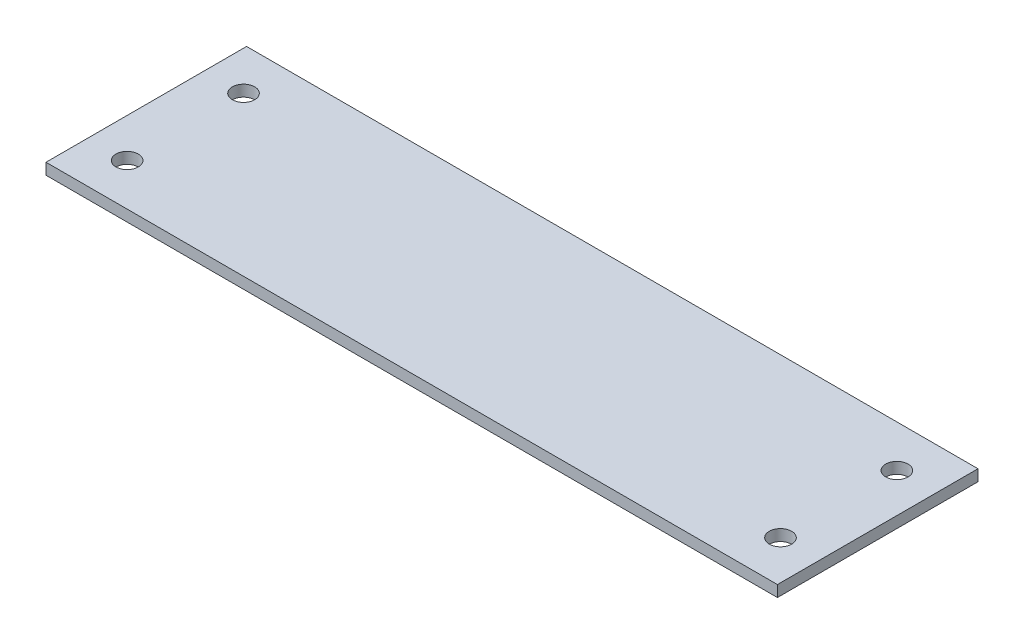
ISO-10303-21;
HEADER;
FILE_DESCRIPTION(('STEP AP214'),'2;1');
FILE_NAME('part.step','',(''),(''),'','','');
FILE_SCHEMA(('AUTOMOTIVE_DESIGN { 1 0 10303 214 1 1 1 1 }'));
ENDSEC;
DATA;
#1=APPLICATION_CONTEXT('core data for automotive mechanical design processes');
#2=APPLICATION_PROTOCOL_DEFINITION('international standard','automotive_design',2000,#1);
#3=PRODUCT_CONTEXT('',#1,'mechanical');
#4=PRODUCT('Part','Part','',(#3));
#5=PRODUCT_RELATED_PRODUCT_CATEGORY('part','',(#4));
#6=PRODUCT_DEFINITION_FORMATION('','',#4);
#7=PRODUCT_DEFINITION_CONTEXT('part definition',#1,'design');
#8=PRODUCT_DEFINITION('design','',#6,#7);
#9=PRODUCT_DEFINITION_SHAPE('','',#8);
#10=(LENGTH_UNIT() NAMED_UNIT(*) SI_UNIT(.MILLI.,.METRE.));
#11=(NAMED_UNIT(*) PLANE_ANGLE_UNIT() SI_UNIT($,.RADIAN.));
#12=(NAMED_UNIT(*) SI_UNIT($,.STERADIAN.) SOLID_ANGLE_UNIT());
#13=UNCERTAINTY_MEASURE_WITH_UNIT(LENGTH_MEASURE(1.E-05),#10,'distance_accuracy_value','');
#14=(GEOMETRIC_REPRESENTATION_CONTEXT(3) GLOBAL_UNCERTAINTY_ASSIGNED_CONTEXT((#13)) GLOBAL_UNIT_ASSIGNED_CONTEXT((#10,
#11,#12)) REPRESENTATION_CONTEXT('',''));
#15=CARTESIAN_POINT('',(0.,0.,0.));
#16=DIRECTION('',(0.,0.,1.));
#17=DIRECTION('',(1.,0.,0.));
#18=AXIS2_PLACEMENT_3D('',#15,#16,#17);
#19=CARTESIAN_POINT('',(-51.875,1.6,14.225));
#20=DIRECTION('',(1.,0.,0.));
#21=DIRECTION('',(0.,0.,-1.));
#22=AXIS2_PLACEMENT_3D('',#19,#20,#21);
#23=PLANE('',#22);
#24=DIRECTION('',(0.,0.,1.));
#25=VECTOR('',#24,1.);
#26=CARTESIAN_POINT('',(-51.875,0.,14.225));
#27=LINE('',#26,#25);
#28=CARTESIAN_POINT('',(-51.875,0.,-14.225));
#29=VERTEX_POINT('',#28);
#30=CARTESIAN_POINT('',(-51.875,0.,14.225));
#31=VERTEX_POINT('',#30);
#32=EDGE_CURVE('E97',#29,#31,#27,.T.);
#33=ORIENTED_EDGE('',*,*,#32,.T.);
#34=DIRECTION('',(0.,-1.,0.));
#35=VECTOR('',#34,1.);
#36=CARTESIAN_POINT('',(-51.875,1.6,14.225));
#37=LINE('',#36,#35);
#38=CARTESIAN_POINT('',(-51.875,1.6,14.225));
#39=VERTEX_POINT('',#38);
#40=EDGE_CURVE('E11',#39,#31,#37,.T.);
#41=ORIENTED_EDGE('',*,*,#40,.F.);
#42=DIRECTION('',(0.,0.,1.));
#43=VECTOR('',#42,1.);
#44=CARTESIAN_POINT('',(-51.875,1.6,14.225));
#45=LINE('',#44,#43);
#46=CARTESIAN_POINT('',(-51.875,1.6,-14.225));
#47=VERTEX_POINT('',#46);
#48=EDGE_CURVE('E85',#47,#39,#45,.T.);
#49=ORIENTED_EDGE('',*,*,#48,.F.);
#50=DIRECTION('',(0.,-1.,0.));
#51=VECTOR('',#50,1.);
#52=CARTESIAN_POINT('',(-51.875,1.6,-14.225));
#53=LINE('',#52,#51);
#54=EDGE_CURVE('E93',#47,#29,#53,.T.);
#55=ORIENTED_EDGE('',*,*,#54,.T.);
#56=EDGE_LOOP('',(#33,#41,#49,#55));
#57=FACE_BOUND('',#56,.T.);
#58=ADVANCED_FACE('F34',(#57),#23,.F.);
#59=CARTESIAN_POINT('',(51.875,1.6,14.225));
#60=DIRECTION('',(0.,0.,-1.));
#61=DIRECTION('',(-1.,0.,0.));
#62=AXIS2_PLACEMENT_3D('',#59,#60,#61);
#63=PLANE('',#62);
#64=DIRECTION('',(1.,0.,0.));
#65=VECTOR('',#64,1.);
#66=CARTESIAN_POINT('',(51.875,0.,14.225));
#67=LINE('',#66,#65);
#68=CARTESIAN_POINT('',(51.875,0.,14.225));
#69=VERTEX_POINT('',#68);
#70=EDGE_CURVE('E89',#31,#69,#67,.T.);
#71=ORIENTED_EDGE('',*,*,#70,.T.);
#72=DIRECTION('',(0.,-1.,0.));
#73=VECTOR('',#72,1.);
#74=CARTESIAN_POINT('',(51.875,1.6,14.225));
#75=LINE('',#74,#73);
#76=CARTESIAN_POINT('',(51.875,1.6,14.225));
#77=VERTEX_POINT('',#76);
#78=EDGE_CURVE('E42',#77,#69,#75,.T.);
#79=ORIENTED_EDGE('',*,*,#78,.F.);
#80=DIRECTION('',(1.,0.,0.));
#81=VECTOR('',#80,1.);
#82=CARTESIAN_POINT('',(51.875,1.6,14.225));
#83=LINE('',#82,#81);
#84=EDGE_CURVE('E80',#39,#77,#83,.T.);
#85=ORIENTED_EDGE('',*,*,#84,.F.);
#86=ORIENTED_EDGE('',*,*,#40,.T.);
#87=EDGE_LOOP('',(#71,#79,#85,#86));
#88=FACE_BOUND('',#87,.T.);
#89=ADVANCED_FACE('F88',(#88),#63,.F.);
#90=CARTESIAN_POINT('',(51.875,1.6,14.225));
#91=DIRECTION('',(-1.,0.,0.));
#92=DIRECTION('',(0.,0.,1.));
#93=AXIS2_PLACEMENT_3D('',#90,#91,#92);
#94=PLANE('',#93);
#95=DIRECTION('',(0.,0.,-1.));
#96=VECTOR('',#95,1.);
#97=CARTESIAN_POINT('',(51.875,0.,14.225));
#98=LINE('',#97,#96);
#99=CARTESIAN_POINT('',(51.875,0.,-14.225));
#100=VERTEX_POINT('',#99);
#101=EDGE_CURVE('E67',#69,#100,#98,.T.);
#102=ORIENTED_EDGE('',*,*,#101,.T.);
#103=DIRECTION('',(0.,-1.,0.));
#104=VECTOR('',#103,1.);
#105=CARTESIAN_POINT('',(51.875,1.6,-14.225));
#106=LINE('',#105,#104);
#107=CARTESIAN_POINT('',(51.875,1.6,-14.225));
#108=VERTEX_POINT('',#107);
#109=EDGE_CURVE('E90',#108,#100,#106,.T.);
#110=ORIENTED_EDGE('',*,*,#109,.F.);
#111=DIRECTION('',(0.,0.,-1.));
#112=VECTOR('',#111,1.);
#113=CARTESIAN_POINT('',(51.875,1.6,14.225));
#114=LINE('',#113,#112);
#115=EDGE_CURVE('E83',#77,#108,#114,.T.);
#116=ORIENTED_EDGE('',*,*,#115,.F.);
#117=ORIENTED_EDGE('',*,*,#78,.T.);
#118=EDGE_LOOP('',(#102,#110,#116,#117));
#119=FACE_BOUND('',#118,.T.);
#120=ADVANCED_FACE('F91',(#119),#94,.F.);
#121=CARTESIAN_POINT('',(51.875,1.6,-14.225));
#122=DIRECTION('',(0.,0.,1.));
#123=DIRECTION('',(1.,0.,0.));
#124=AXIS2_PLACEMENT_3D('',#121,#122,#123);
#125=PLANE('',#124);
#126=DIRECTION('',(-1.,0.,0.));
#127=VECTOR('',#126,1.);
#128=CARTESIAN_POINT('',(51.875,0.,-14.225));
#129=LINE('',#128,#127);
#130=EDGE_CURVE('E73',#100,#29,#129,.T.);
#131=ORIENTED_EDGE('',*,*,#130,.T.);
#132=ORIENTED_EDGE('',*,*,#54,.F.);
#133=DIRECTION('',(-1.,0.,0.));
#134=VECTOR('',#133,1.);
#135=CARTESIAN_POINT('',(51.875,1.6,-14.225));
#136=LINE('',#135,#134);
#137=EDGE_CURVE('E50',#108,#47,#136,.T.);
#138=ORIENTED_EDGE('',*,*,#137,.F.);
#139=ORIENTED_EDGE('',*,*,#109,.T.);
#140=EDGE_LOOP('',(#131,#132,#138,#139));
#141=FACE_BOUND('',#140,.T.);
#142=ADVANCED_FACE('F105',(#141),#125,.F.);
#143=CARTESIAN_POINT('',(0.,1.6,0.));
#144=DIRECTION('',(0.,1.,0.));
#145=DIRECTION('',(0.,0.,1.));
#146=AXIS2_PLACEMENT_3D('',#143,#144,#145);
#147=PLANE('',#146);
#148=CARTESIAN_POINT('',(46.3378,1.6,8.256));
#149=DIRECTION('',(0.,1.,0.));
#150=DIRECTION('',(0.,0.,-1.));
#151=AXIS2_PLACEMENT_3D('',#148,#149,#150);
#152=CIRCLE('',#151,1.5875);
#153=CARTESIAN_POINT('',(46.3378,1.6,6.6685));
#154=VERTEX_POINT('',#153);
#155=EDGE_CURVE('E124',#154,#154,#152,.T.);
#156=ORIENTED_EDGE('',*,*,#155,.F.);
#157=EDGE_LOOP('',(#156));
#158=FACE_BOUND('',#157,.T.);
#159=CARTESIAN_POINT('',(-46.3378,1.6,-8.25600000000001));
#160=DIRECTION('',(0.,1.,0.));
#161=DIRECTION('',(0.,0.,-1.));
#162=AXIS2_PLACEMENT_3D('',#159,#160,#161);
#163=CIRCLE('',#162,1.5875);
#164=CARTESIAN_POINT('',(-46.3378,1.6,-9.84350000000001));
#165=VERTEX_POINT('',#164);
#166=EDGE_CURVE('E117',#165,#165,#163,.T.);
#167=ORIENTED_EDGE('',*,*,#166,.F.);
#168=EDGE_LOOP('',(#167));
#169=FACE_BOUND('',#168,.T.);
#170=CARTESIAN_POINT('',(-46.3378,1.6,8.25599999999999));
#171=DIRECTION('',(0.,1.,0.));
#172=DIRECTION('',(0.,0.,1.));
#173=AXIS2_PLACEMENT_3D('',#170,#171,#172);
#174=CIRCLE('',#173,1.5875);
#175=CARTESIAN_POINT('',(-46.3378,1.6,9.84349999999999));
#176=VERTEX_POINT('',#175);
#177=EDGE_CURVE('E129',#176,#176,#174,.T.);
#178=ORIENTED_EDGE('',*,*,#177,.F.);
#179=EDGE_LOOP('',(#178));
#180=FACE_BOUND('',#179,.T.);
#181=CARTESIAN_POINT('',(46.3378,1.6,-8.256));
#182=DIRECTION('',(0.,1.,0.));
#183=DIRECTION('',(0.,0.,1.));
#184=AXIS2_PLACEMENT_3D('',#181,#182,#183);
#185=CIRCLE('',#184,1.5875);
#186=CARTESIAN_POINT('',(46.3378,1.6,-6.6685));
#187=VERTEX_POINT('',#186);
#188=EDGE_CURVE('E111',#187,#187,#185,.T.);
#189=ORIENTED_EDGE('',*,*,#188,.F.);
#190=EDGE_LOOP('',(#189));
#191=FACE_BOUND('',#190,.T.);
#192=ORIENTED_EDGE('',*,*,#48,.T.);
#193=ORIENTED_EDGE('',*,*,#84,.T.);
#194=ORIENTED_EDGE('',*,*,#115,.T.);
#195=ORIENTED_EDGE('',*,*,#137,.T.);
#196=EDGE_LOOP('',(#192,#193,#194,#195));
#197=FACE_BOUND('',#196,.T.);
#198=ADVANCED_FACE('F81',(#158,#169,#180,#191,#197),#147,.T.);
#199=CARTESIAN_POINT('',(0.,0.,0.));
#200=DIRECTION('',(0.,1.,0.));
#201=DIRECTION('',(0.,0.,1.));
#202=AXIS2_PLACEMENT_3D('',#199,#200,#201);
#203=PLANE('',#202);
#204=CARTESIAN_POINT('',(46.3378,0.,8.256));
#205=DIRECTION('',(0.,1.,0.));
#206=DIRECTION('',(0.,0.,-1.));
#207=AXIS2_PLACEMENT_3D('',#204,#205,#206);
#208=CIRCLE('',#207,1.5875);
#209=CARTESIAN_POINT('',(46.3378,0.,6.6685));
#210=VERTEX_POINT('',#209);
#211=EDGE_CURVE('E114',#210,#210,#208,.T.);
#212=ORIENTED_EDGE('',*,*,#211,.T.);
#213=EDGE_LOOP('',(#212));
#214=FACE_BOUND('',#213,.T.);
#215=CARTESIAN_POINT('',(-46.3378,0.,-8.25600000000001));
#216=DIRECTION('',(0.,1.,0.));
#217=DIRECTION('',(0.,0.,-1.));
#218=AXIS2_PLACEMENT_3D('',#215,#216,#217);
#219=CIRCLE('',#218,1.5875);
#220=CARTESIAN_POINT('',(-46.3378,0.,-9.84350000000001));
#221=VERTEX_POINT('',#220);
#222=EDGE_CURVE('E120',#221,#221,#219,.T.);
#223=ORIENTED_EDGE('',*,*,#222,.T.);
#224=EDGE_LOOP('',(#223));
#225=FACE_BOUND('',#224,.T.);
#226=CARTESIAN_POINT('',(-46.3378,0.,8.25599999999999));
#227=DIRECTION('',(0.,1.,0.));
#228=DIRECTION('',(0.,0.,1.));
#229=AXIS2_PLACEMENT_3D('',#226,#227,#228);
#230=CIRCLE('',#229,1.5875);
#231=CARTESIAN_POINT('',(-46.3378,0.,9.84349999999999));
#232=VERTEX_POINT('',#231);
#233=EDGE_CURVE('E121',#232,#232,#230,.T.);
#234=ORIENTED_EDGE('',*,*,#233,.T.);
#235=EDGE_LOOP('',(#234));
#236=FACE_BOUND('',#235,.T.);
#237=CARTESIAN_POINT('',(46.3378,0.,-8.256));
#238=DIRECTION('',(0.,1.,0.));
#239=DIRECTION('',(0.,0.,1.));
#240=AXIS2_PLACEMENT_3D('',#237,#238,#239);
#241=CIRCLE('',#240,1.5875);
#242=CARTESIAN_POINT('',(46.3378,0.,-6.6685));
#243=VERTEX_POINT('',#242);
#244=EDGE_CURVE('E100',#243,#243,#241,.T.);
#245=ORIENTED_EDGE('',*,*,#244,.T.);
#246=EDGE_LOOP('',(#245));
#247=FACE_BOUND('',#246,.T.);
#248=ORIENTED_EDGE('',*,*,#32,.F.);
#249=ORIENTED_EDGE('',*,*,#130,.F.);
#250=ORIENTED_EDGE('',*,*,#101,.F.);
#251=ORIENTED_EDGE('',*,*,#70,.F.);
#252=EDGE_LOOP('',(#248,#249,#250,#251));
#253=FACE_BOUND('',#252,.T.);
#254=ADVANCED_FACE('F108',(#214,#225,#236,#247,#253),#203,.F.);
#255=CARTESIAN_POINT('',(46.3378,0.,-8.256));
#256=DIRECTION('',(0.,1.,0.));
#257=DIRECTION('',(0.,0.,1.));
#258=AXIS2_PLACEMENT_3D('',#255,#256,#257);
#259=CYLINDRICAL_SURFACE('',#258,1.5875);
#260=ORIENTED_EDGE('',*,*,#244,.F.);
#261=EDGE_LOOP('',(#260));
#262=FACE_BOUND('',#261,.T.);
#263=ORIENTED_EDGE('',*,*,#188,.T.);
#264=EDGE_LOOP('',(#263));
#265=FACE_BOUND('',#264,.T.);
#266=ADVANCED_FACE('F141',(#262,#265),#259,.F.);
#267=CARTESIAN_POINT('',(-46.3378,0.,8.25599999999999));
#268=DIRECTION('',(0.,1.,0.));
#269=DIRECTION('',(0.,0.,1.));
#270=AXIS2_PLACEMENT_3D('',#267,#268,#269);
#271=CYLINDRICAL_SURFACE('',#270,1.5875);
#272=ORIENTED_EDGE('',*,*,#233,.F.);
#273=EDGE_LOOP('',(#272));
#274=FACE_BOUND('',#273,.T.);
#275=ORIENTED_EDGE('',*,*,#177,.T.);
#276=EDGE_LOOP('',(#275));
#277=FACE_BOUND('',#276,.T.);
#278=ADVANCED_FACE('F137',(#274,#277),#271,.F.);
#279=CARTESIAN_POINT('',(-46.3378,0.,-8.25600000000001));
#280=DIRECTION('',(0.,1.,0.));
#281=DIRECTION('',(0.,0.,1.));
#282=AXIS2_PLACEMENT_3D('',#279,#280,#281);
#283=CYLINDRICAL_SURFACE('',#282,1.5875);
#284=ORIENTED_EDGE('',*,*,#222,.F.);
#285=EDGE_LOOP('',(#284));
#286=FACE_BOUND('',#285,.T.);
#287=ORIENTED_EDGE('',*,*,#166,.T.);
#288=EDGE_LOOP('',(#287));
#289=FACE_BOUND('',#288,.T.);
#290=ADVANCED_FACE('F140',(#286,#289),#283,.F.);
#291=CARTESIAN_POINT('',(46.3378,0.,8.256));
#292=DIRECTION('',(0.,1.,0.));
#293=DIRECTION('',(0.,0.,1.));
#294=AXIS2_PLACEMENT_3D('',#291,#292,#293);
#295=CYLINDRICAL_SURFACE('',#294,1.5875);
#296=ORIENTED_EDGE('',*,*,#211,.F.);
#297=EDGE_LOOP('',(#296));
#298=FACE_BOUND('',#297,.T.);
#299=ORIENTED_EDGE('',*,*,#155,.T.);
#300=EDGE_LOOP('',(#299));
#301=FACE_BOUND('',#300,.T.);
#302=ADVANCED_FACE('F202',(#298,#301),#295,.F.);
#303=CLOSED_SHELL('',(#58,#89,#120,#142,#198,#254,#266,#278,#290,#302));
#304=MANIFOLD_SOLID_BREP('B2',#303);
#305=ADVANCED_BREP_SHAPE_REPRESENTATION('',(#18,#304),#14);
#306=SHAPE_DEFINITION_REPRESENTATION(#9,#305);
ENDSEC;
END-ISO-10303-21;
